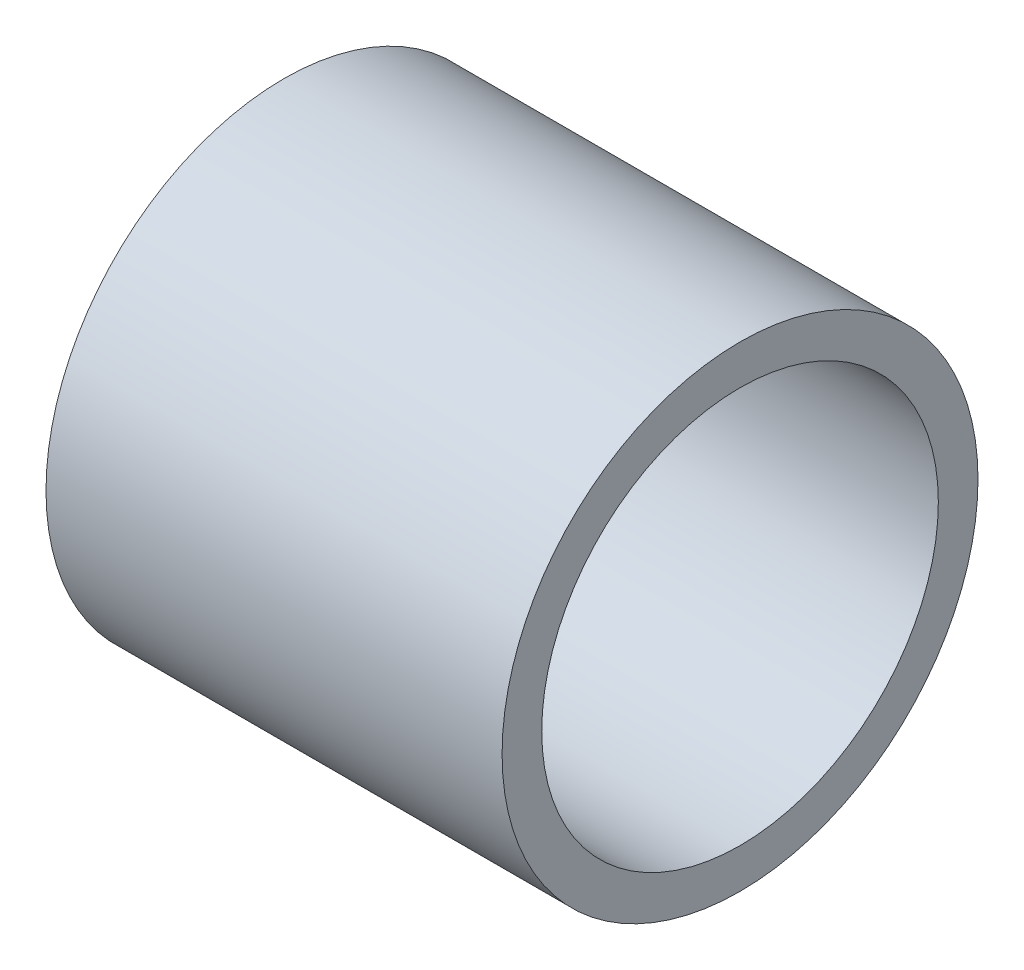
ISO-10303-21;
HEADER;
FILE_DESCRIPTION(('STEP AP214'),'2;1');
FILE_NAME('part.step','',(''),(''),'','','');
FILE_SCHEMA(('AUTOMOTIVE_DESIGN { 1 0 10303 214 1 1 1 1 }'));
ENDSEC;
DATA;
#1=APPLICATION_CONTEXT('core data for automotive mechanical design processes');
#2=APPLICATION_PROTOCOL_DEFINITION('international standard','automotive_design',2000,#1);
#3=PRODUCT_CONTEXT('',#1,'mechanical');
#4=PRODUCT('Part','Part','',(#3));
#5=PRODUCT_RELATED_PRODUCT_CATEGORY('part','',(#4));
#6=PRODUCT_DEFINITION_FORMATION('','',#4);
#7=PRODUCT_DEFINITION_CONTEXT('part definition',#1,'design');
#8=PRODUCT_DEFINITION('design','',#6,#7);
#9=PRODUCT_DEFINITION_SHAPE('','',#8);
#10=(LENGTH_UNIT() NAMED_UNIT(*) SI_UNIT(.MILLI.,.METRE.));
#11=(NAMED_UNIT(*) PLANE_ANGLE_UNIT() SI_UNIT($,.RADIAN.));
#12=(NAMED_UNIT(*) SI_UNIT($,.STERADIAN.) SOLID_ANGLE_UNIT());
#13=UNCERTAINTY_MEASURE_WITH_UNIT(LENGTH_MEASURE(1.E-05),#10,'distance_accuracy_value','');
#14=(GEOMETRIC_REPRESENTATION_CONTEXT(3) GLOBAL_UNCERTAINTY_ASSIGNED_CONTEXT((#13)) GLOBAL_UNIT_ASSIGNED_CONTEXT((#10,
#11,#12)) REPRESENTATION_CONTEXT('',''));
#15=CARTESIAN_POINT('',(0.,0.,0.));
#16=DIRECTION('',(0.,0.,1.));
#17=DIRECTION('',(1.,0.,0.));
#18=AXIS2_PLACEMENT_3D('',#15,#16,#17);
#19=CARTESIAN_POINT('',(13.,0.,0.));
#20=DIRECTION('',(-1.,0.,0.));
#21=DIRECTION('',(0.,0.,1.));
#22=AXIS2_PLACEMENT_3D('',#19,#20,#21);
#23=CYLINDRICAL_SURFACE('',#22,6.);
#24=CARTESIAN_POINT('',(1.5,0.,0.));
#25=DIRECTION('',(1.,0.,0.));
#26=DIRECTION('',(0.,0.,-1.));
#27=AXIS2_PLACEMENT_3D('',#24,#25,#26);
#28=CIRCLE('',#27,6.);
#29=CARTESIAN_POINT('',(1.5,0.,6.));
#30=VERTEX_POINT('',#29);
#31=EDGE_CURVE('E42',#30,#30,#28,.T.);
#32=CARTESIAN_POINT('',(13.,0.,0.));
#33=DIRECTION('',(1.,0.,0.));
#34=DIRECTION('',(0.,0.,-1.));
#35=AXIS2_PLACEMENT_3D('',#32,#33,#34);
#36=CIRCLE('',#35,6.);
#37=CARTESIAN_POINT('',(13.,0.,6.));
#38=VERTEX_POINT('',#37);
#39=EDGE_CURVE('E11',#38,#38,#36,.T.);
#40=CARTESIAN_POINT('',(1.5,0.,6.));
#41=CARTESIAN_POINT('',(1.61979166666667,0.,6.));
#42=CARTESIAN_POINT('',(1.73958333333334,0.,6.));
#43=CARTESIAN_POINT('',(1.97916666666667,0.,6.));
#44=CARTESIAN_POINT('',(2.09895833333334,0.,6.));
#45=CARTESIAN_POINT('',(2.33854166666667,0.,6.));
#46=CARTESIAN_POINT('',(2.45833333333333,0.,6.));
#47=CARTESIAN_POINT('',(2.69791666666667,0.,6.));
#48=CARTESIAN_POINT('',(2.81770833333333,0.,6.));
#49=CARTESIAN_POINT('',(3.05729166666667,0.,6.));
#50=CARTESIAN_POINT('',(3.17708333333333,0.,6.));
#51=CARTESIAN_POINT('',(3.41666666666667,0.,6.));
#52=CARTESIAN_POINT('',(3.53645833333333,0.,6.));
#53=CARTESIAN_POINT('',(3.77604166666667,0.,6.));
#54=CARTESIAN_POINT('',(3.89583333333333,0.,6.));
#55=CARTESIAN_POINT('',(4.13541666666667,0.,6.));
#56=CARTESIAN_POINT('',(4.25520833333333,0.,6.));
#57=CARTESIAN_POINT('',(4.49479166666667,0.,6.));
#58=CARTESIAN_POINT('',(4.61458333333333,0.,6.));
#59=CARTESIAN_POINT('',(4.85416666666667,0.,6.));
#60=CARTESIAN_POINT('',(4.97395833333333,0.,6.));
#61=CARTESIAN_POINT('',(5.21354166666667,0.,6.));
#62=CARTESIAN_POINT('',(5.33333333333333,0.,6.));
#63=CARTESIAN_POINT('',(5.57291666666667,0.,6.));
#64=CARTESIAN_POINT('',(5.69270833333333,0.,6.));
#65=CARTESIAN_POINT('',(5.93229166666667,0.,6.));
#66=CARTESIAN_POINT('',(6.05208333333333,0.,6.));
#67=CARTESIAN_POINT('',(6.29166666666667,0.,6.));
#68=CARTESIAN_POINT('',(6.41145833333333,0.,6.));
#69=CARTESIAN_POINT('',(6.65104166666667,0.,6.));
#70=CARTESIAN_POINT('',(6.77083333333333,0.,6.));
#71=CARTESIAN_POINT('',(7.01041666666667,0.,6.));
#72=CARTESIAN_POINT('',(7.13020833333333,0.,6.));
#73=CARTESIAN_POINT('',(7.36979166666667,0.,6.));
#74=CARTESIAN_POINT('',(7.48958333333333,0.,6.));
#75=CARTESIAN_POINT('',(7.72916666666667,0.,6.));
#76=CARTESIAN_POINT('',(7.84895833333333,0.,6.));
#77=CARTESIAN_POINT('',(8.08854166666667,0.,6.));
#78=CARTESIAN_POINT('',(8.20833333333333,0.,6.));
#79=CARTESIAN_POINT('',(8.44791666666667,0.,6.));
#80=CARTESIAN_POINT('',(8.56770833333333,0.,6.));
#81=CARTESIAN_POINT('',(8.80729166666667,0.,6.));
#82=CARTESIAN_POINT('',(8.92708333333333,0.,6.));
#83=CARTESIAN_POINT('',(9.16666666666667,0.,6.));
#84=CARTESIAN_POINT('',(9.28645833333333,0.,6.));
#85=CARTESIAN_POINT('',(9.52604166666667,0.,6.));
#86=CARTESIAN_POINT('',(9.64583333333333,0.,6.));
#87=CARTESIAN_POINT('',(9.88541666666667,0.,6.));
#88=CARTESIAN_POINT('',(10.0052083333333,0.,6.));
#89=CARTESIAN_POINT('',(10.2447916666667,0.,6.));
#90=CARTESIAN_POINT('',(10.3645833333333,0.,6.));
#91=CARTESIAN_POINT('',(10.6041666666667,0.,6.));
#92=CARTESIAN_POINT('',(10.7239583333333,0.,6.));
#93=CARTESIAN_POINT('',(10.9635416666667,0.,6.));
#94=CARTESIAN_POINT('',(11.0833333333333,0.,6.));
#95=CARTESIAN_POINT('',(11.3229166666667,0.,6.));
#96=CARTESIAN_POINT('',(11.4427083333333,0.,6.));
#97=CARTESIAN_POINT('',(11.6822916666667,0.,6.));
#98=CARTESIAN_POINT('',(11.8020833333333,0.,6.));
#99=CARTESIAN_POINT('',(12.0416666666667,0.,6.));
#100=CARTESIAN_POINT('',(12.1614583333333,0.,6.));
#101=CARTESIAN_POINT('',(12.4010416666667,0.,6.));
#102=CARTESIAN_POINT('',(12.5208333333333,0.,6.));
#103=CARTESIAN_POINT('',(12.7604166666667,0.,6.));
#104=CARTESIAN_POINT('',(12.8802083333333,0.,6.));
#105=CARTESIAN_POINT('',(13.,0.,6.));
#106=B_SPLINE_CURVE_WITH_KNOTS('',3,(#40,#41,#42,#43,#44,#45,#46,#47,#48,#49,#50,#51,#52,#53,
#54,#55,#56,#57,#58,#59,#60,#61,#62,#63,#64,#65,#66,#67,#68,#69,#70,#71,#72,#73,#74,#75,#76,#77,
#78,#79,#80,#81,#82,#83,#84,#85,#86,#87,#88,#89,#90,#91,#92,#93,#94,#95,#96,#97,#98,#99,#100,
#101,#102,#103,#104,#105),.UNSPECIFIED.,.F.,.F.,(4,2,2,2,2,2,2,2,2,2,2,2,2,2,2,2,2,2,2,2,2,2,2,
2,2,2,2,2,2,2,2,2,4),(0.,0.359375,0.718750000000001,1.078125,1.4375,1.796875,2.15625,2.515625,
2.875,3.234375,3.59375,3.953125,4.3125,4.671875,5.03125,5.390625,5.75,6.109375,6.46875,6.828125,
7.1875,7.546875,7.90625,8.265625,8.625,8.984375,9.34375,9.703125,10.0625,10.421875,10.78125,
11.140625,11.5),.UNSPECIFIED.);
#107=EDGE_CURVE('BSEAM35',#30,#38,#106,.T.);
#108=ORIENTED_EDGE('',*,*,#31,.T.);
#109=ORIENTED_EDGE('',*,*,#39,.F.);
#110=ORIENTED_EDGE('',*,*,#107,.T.);
#111=ORIENTED_EDGE('',*,*,#107,.F.);
#112=EDGE_LOOP('',(#108,#110,#109,#111));
#113=FACE_BOUND('',#112,.T.);
#114=ADVANCED_FACE('F35',(#113),#23,.T.);
#115=CARTESIAN_POINT('',(13.,0.,0.));
#116=DIRECTION('',(1.,0.,0.));
#117=DIRECTION('',(0.,0.,-1.));
#118=AXIS2_PLACEMENT_3D('',#115,#116,#117);
#119=PLANE('',#118);
#120=CARTESIAN_POINT('',(13.,0.,0.));
#121=DIRECTION('',(1.,0.,0.));
#122=DIRECTION('',(0.,0.,-1.));
#123=AXIS2_PLACEMENT_3D('',#120,#121,#122);
#124=CIRCLE('',#123,5.);
#125=CARTESIAN_POINT('',(13.,0.,5.));
#126=VERTEX_POINT('',#125);
#127=EDGE_CURVE('E74',#126,#126,#124,.T.);
#128=ORIENTED_EDGE('',*,*,#127,.F.);
#129=EDGE_LOOP('',(#128));
#130=FACE_BOUND('',#129,.T.);
#131=ORIENTED_EDGE('',*,*,#39,.T.);
#132=EDGE_LOOP('',(#131));
#133=FACE_BOUND('',#132,.T.);
#134=ADVANCED_FACE('F62',(#130,#133),#119,.T.);
#135=CARTESIAN_POINT('',(0.,0.,0.));
#136=DIRECTION('',(1.,0.,0.));
#137=DIRECTION('',(0.,0.,-1.));
#138=AXIS2_PLACEMENT_3D('',#135,#136,#137);
#139=CONICAL_SURFACE('',#138,0.,1.32581766366803);
#140=ORIENTED_EDGE('',*,*,#31,.F.);
#141=EDGE_LOOP('',(#140));
#142=FACE_BOUND('',#141,.T.);
#143=CARTESIAN_POINT('',(0.,0.,0.));
#144=VERTEX_POINT('',#143);
#145=VERTEX_LOOP('',#144);
#146=FACE_BOUND('',#145,.T.);
#147=ADVANCED_FACE('F56',(#142,#146),#139,.T.);
#148=CARTESIAN_POINT('',(13.,0.,0.));
#149=DIRECTION('',(-1.,0.,0.));
#150=DIRECTION('',(0.,0.,1.));
#151=AXIS2_PLACEMENT_3D('',#148,#149,#150);
#152=CYLINDRICAL_SURFACE('',#151,5.);
#153=CARTESIAN_POINT('',(2.28077640640441,0.,0.));
#154=DIRECTION('',(1.,0.,0.));
#155=DIRECTION('',(0.,0.,-1.));
#156=AXIS2_PLACEMENT_3D('',#153,#154,#155);
#157=CIRCLE('',#156,5.);
#158=CARTESIAN_POINT('',(2.28077640640442,0.,5.));
#159=VERTEX_POINT('',#158);
#160=EDGE_CURVE('E76',#159,#159,#157,.T.);
#161=CARTESIAN_POINT('',(2.28077640640442,0.,5.));
#162=CARTESIAN_POINT('',(2.39243498550437,0.,5.));
#163=CARTESIAN_POINT('',(2.50409356460432,0.,5.));
#164=CARTESIAN_POINT('',(2.72741072280423,0.,5.));
#165=CARTESIAN_POINT('',(2.83906930190419,0.,5.));
#166=CARTESIAN_POINT('',(3.06238646010409,0.,5.));
#167=CARTESIAN_POINT('',(3.17404503920405,0.,5.));
#168=CARTESIAN_POINT('',(3.39736219740396,0.,5.));
#169=CARTESIAN_POINT('',(3.50902077650391,0.,5.));
#170=CARTESIAN_POINT('',(3.73233793470382,0.,5.));
#171=CARTESIAN_POINT('',(3.84399651380377,0.,5.));
#172=CARTESIAN_POINT('',(4.06731367200368,0.,5.));
#173=CARTESIAN_POINT('',(4.17897225110363,0.,5.));
#174=CARTESIAN_POINT('',(4.40228940930354,0.,5.));
#175=CARTESIAN_POINT('',(4.51394798840349,0.,5.));
#176=CARTESIAN_POINT('',(4.7372651466034,0.,5.));
#177=CARTESIAN_POINT('',(4.84892372570336,0.,5.));
#178=CARTESIAN_POINT('',(5.07224088390327,0.,5.));
#179=CARTESIAN_POINT('',(5.18389946300322,0.,5.));
#180=CARTESIAN_POINT('',(5.40721662120313,0.,5.));
#181=CARTESIAN_POINT('',(5.51887520030308,0.,5.));
#182=CARTESIAN_POINT('',(5.74219235850299,0.,5.));
#183=CARTESIAN_POINT('',(5.85385093760294,0.,5.));
#184=CARTESIAN_POINT('',(6.07716809580285,0.,5.));
#185=CARTESIAN_POINT('',(6.18882667490281,0.,5.));
#186=CARTESIAN_POINT('',(6.41214383310271,0.,5.));
#187=CARTESIAN_POINT('',(6.52380241220267,0.,5.));
#188=CARTESIAN_POINT('',(6.74711957040258,0.,5.));
#189=CARTESIAN_POINT('',(6.85877814950253,0.,5.));
#190=CARTESIAN_POINT('',(7.08209530770244,0.,5.));
#191=CARTESIAN_POINT('',(7.19375388680239,0.,5.));
#192=CARTESIAN_POINT('',(7.4170710450023,0.,5.));
#193=CARTESIAN_POINT('',(7.52872962410225,0.,5.));
#194=CARTESIAN_POINT('',(7.75204678230216,0.,5.));
#195=CARTESIAN_POINT('',(7.86370536140211,0.,5.));
#196=CARTESIAN_POINT('',(8.08702251960202,0.,5.));
#197=CARTESIAN_POINT('',(8.19868109870198,0.,5.));
#198=CARTESIAN_POINT('',(8.42199825690189,0.,5.));
#199=CARTESIAN_POINT('',(8.53365683600184,0.,5.));
#200=CARTESIAN_POINT('',(8.75697399420175,0.,5.));
#201=CARTESIAN_POINT('',(8.8686325733017,0.,5.));
#202=CARTESIAN_POINT('',(9.09194973150161,0.,5.));
#203=CARTESIAN_POINT('',(9.20360831060156,0.,5.));
#204=CARTESIAN_POINT('',(9.42692546880147,0.,5.));
#205=CARTESIAN_POINT('',(9.53858404790143,0.,5.));
#206=CARTESIAN_POINT('',(9.76190120610133,0.,5.));
#207=CARTESIAN_POINT('',(9.87355978520129,0.,5.));
#208=CARTESIAN_POINT('',(10.0968769434012,0.,5.));
#209=CARTESIAN_POINT('',(10.2085355225011,0.,5.));
#210=CARTESIAN_POINT('',(10.4318526807011,0.,5.));
#211=CARTESIAN_POINT('',(10.543511259801,0.,5.));
#212=CARTESIAN_POINT('',(10.7668284180009,0.,5.));
#213=CARTESIAN_POINT('',(10.8784869971009,0.,5.));
#214=CARTESIAN_POINT('',(11.1018041553008,0.,5.));
#215=CARTESIAN_POINT('',(11.2134627344007,0.,5.));
#216=CARTESIAN_POINT('',(11.4367798926006,0.,5.));
#217=CARTESIAN_POINT('',(11.5484384717006,0.,5.));
#218=CARTESIAN_POINT('',(11.7717556299005,0.,5.));
#219=CARTESIAN_POINT('',(11.8834142090005,0.,5.));
#220=CARTESIAN_POINT('',(12.1067313672004,0.,5.));
#221=CARTESIAN_POINT('',(12.2183899463003,0.,5.));
#222=CARTESIAN_POINT('',(12.4417071045002,0.,5.));
#223=CARTESIAN_POINT('',(12.5533656836002,0.,5.));
#224=CARTESIAN_POINT('',(12.7766828418001,0.,5.));
#225=CARTESIAN_POINT('',(12.8883414209,0.,5.));
#226=CARTESIAN_POINT('',(13.,0.,5.));
#227=B_SPLINE_CURVE_WITH_KNOTS('',3,(#161,#162,#163,#164,#165,#166,#167,#168,#169,#170,#171,
#172,#173,#174,#175,#176,#177,#178,#179,#180,#181,#182,#183,#184,#185,#186,#187,#188,#189,#190,
#191,#192,#193,#194,#195,#196,#197,#198,#199,#200,#201,#202,#203,#204,#205,#206,#207,#208,#209,
#210,#211,#212,#213,#214,#215,#216,#217,#218,#219,#220,#221,#222,#223,#224,#225,#226),
.UNSPECIFIED.,.F.,.F.,(4,2,2,2,2,2,2,2,2,2,2,2,2,2,2,2,2,2,2,2,2,2,2,2,2,2,2,2,2,2,2,2,4),(0.,
0.334975737299861,0.669951474599724,1.00492721189959,1.33990294919945,1.67487868649931,
2.00985442379917,2.34483016109903,2.6798058983989,3.01478163569876,3.34975737299862,
3.68473311029848,4.01970884759834,4.35468458489821,4.68966032219807,5.02463605949793,
5.35961179679779,5.69458753409765,6.02956327139752,6.36453900869738,6.69951474599724,
7.0344904832971,7.36946622059696,7.70444195789683,8.03941769519669,8.37439343249655,
8.70936916979641,9.04434490709627,9.37932064439613,9.714296381696,10.0492721189959,
10.3842478562957,10.7192235935956),.UNSPECIFIED.);
#228=EDGE_CURVE('BSEAM50',#159,#126,#227,.T.);
#229=ORIENTED_EDGE('',*,*,#160,.F.);
#230=ORIENTED_EDGE('',*,*,#127,.T.);
#231=ORIENTED_EDGE('',*,*,#228,.T.);
#232=ORIENTED_EDGE('',*,*,#228,.F.);
#233=EDGE_LOOP('',(#229,#231,#230,#232));
#234=FACE_BOUND('',#233,.T.);
#235=ADVANCED_FACE('F50',(#234),#152,.F.);
#236=CARTESIAN_POINT('',(1.03077640640442,0.,0.));
#237=DIRECTION('',(1.,0.,0.));
#238=DIRECTION('',(0.,0.,-1.));
#239=AXIS2_PLACEMENT_3D('',#236,#237,#238);
#240=CONICAL_SURFACE('',#239,0.,1.32581766366803);
#241=ORIENTED_EDGE('',*,*,#160,.T.);
#242=EDGE_LOOP('',(#241));
#243=FACE_BOUND('',#242,.T.);
#244=CARTESIAN_POINT('',(1.03077640640442,0.,0.));
#245=VERTEX_POINT('',#244);
#246=VERTEX_LOOP('',#245);
#247=FACE_BOUND('',#246,.T.);
#248=ADVANCED_FACE('F48',(#243,#247),#240,.F.);
#249=CLOSED_SHELL('',(#114,#134,#147,#235,#248));
#250=MANIFOLD_SOLID_BREP('B2',#249);
#251=ADVANCED_BREP_SHAPE_REPRESENTATION('',(#18,#250),#14);
#252=SHAPE_DEFINITION_REPRESENTATION(#9,#251);
ENDSEC;
END-ISO-10303-21;
